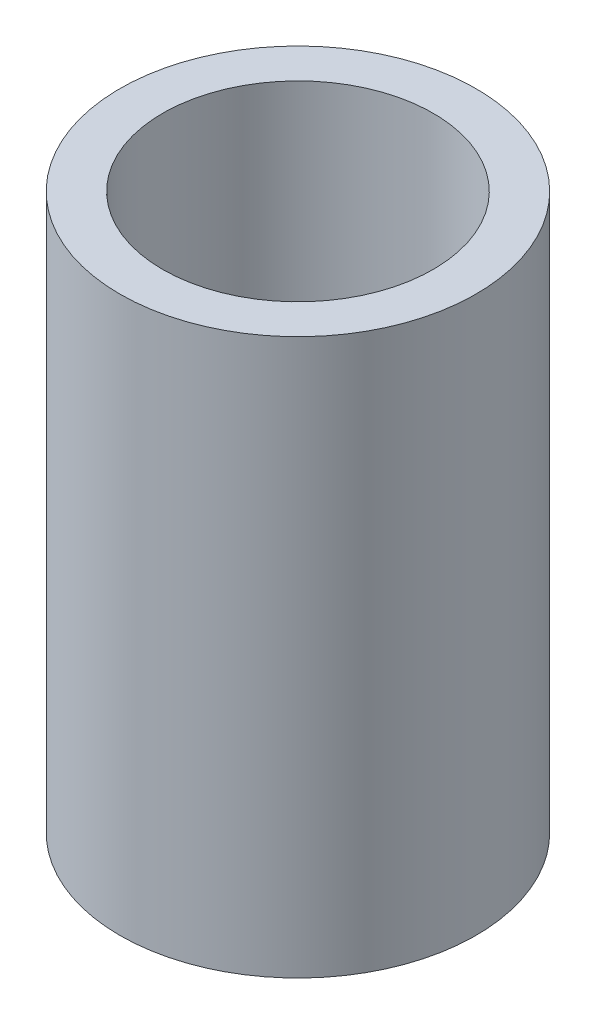
ISO-10303-21;
HEADER;
FILE_DESCRIPTION(('STEP AP214'),'2;1');
FILE_NAME('part.step','',(''),(''),'','','');
FILE_SCHEMA(('AUTOMOTIVE_DESIGN { 1 0 10303 214 1 1 1 1 }'));
ENDSEC;
DATA;
#1=APPLICATION_CONTEXT('core data for automotive mechanical design processes');
#2=APPLICATION_PROTOCOL_DEFINITION('international standard','automotive_design',2000,#1);
#3=PRODUCT_CONTEXT('',#1,'mechanical');
#4=PRODUCT('Part','Part','',(#3));
#5=PRODUCT_RELATED_PRODUCT_CATEGORY('part','',(#4));
#6=PRODUCT_DEFINITION_FORMATION('','',#4);
#7=PRODUCT_DEFINITION_CONTEXT('part definition',#1,'design');
#8=PRODUCT_DEFINITION('design','',#6,#7);
#9=PRODUCT_DEFINITION_SHAPE('','',#8);
#10=(LENGTH_UNIT() NAMED_UNIT(*) SI_UNIT(.MILLI.,.METRE.));
#11=(NAMED_UNIT(*) PLANE_ANGLE_UNIT() SI_UNIT($,.RADIAN.));
#12=(NAMED_UNIT(*) SI_UNIT($,.STERADIAN.) SOLID_ANGLE_UNIT());
#13=UNCERTAINTY_MEASURE_WITH_UNIT(LENGTH_MEASURE(1.E-05),#10,'distance_accuracy_value','');
#14=(GEOMETRIC_REPRESENTATION_CONTEXT(3) GLOBAL_UNCERTAINTY_ASSIGNED_CONTEXT((#13)) GLOBAL_UNIT_ASSIGNED_CONTEXT((#10,
#11,#12)) REPRESENTATION_CONTEXT('',''));
#15=CARTESIAN_POINT('',(0.,0.,0.));
#16=DIRECTION('',(0.,0.,1.));
#17=DIRECTION('',(1.,0.,0.));
#18=AXIS2_PLACEMENT_3D('',#15,#16,#17);
#19=CARTESIAN_POINT('',(0.,39.,0.));
#20=DIRECTION('',(0.,1.,0.));
#21=DIRECTION('',(0.,0.,1.));
#22=AXIS2_PLACEMENT_3D('',#19,#20,#21);
#23=PLANE('',#22);
#24=CARTESIAN_POINT('',(0.,39.,0.));
#25=DIRECTION('',(0.,1.,0.));
#26=DIRECTION('',(0.,0.,1.));
#27=AXIS2_PLACEMENT_3D('',#24,#25,#26);
#28=CIRCLE('',#27,12.5);
#29=CARTESIAN_POINT('',(0.,39.,12.5));
#30=VERTEX_POINT('',#29);
#31=EDGE_CURVE('E10',#30,#30,#28,.T.);
#32=ORIENTED_EDGE('',*,*,#31,.T.);
#33=EDGE_LOOP('',(#32));
#34=FACE_BOUND('',#33,.T.);
#35=CARTESIAN_POINT('',(0.,39.,0.));
#36=DIRECTION('',(0.,1.,0.));
#37=DIRECTION('',(0.,0.,1.));
#38=AXIS2_PLACEMENT_3D('',#35,#36,#37);
#39=CIRCLE('',#38,9.5);
#40=CARTESIAN_POINT('',(0.,39.,9.5));
#41=VERTEX_POINT('',#40);
#42=EDGE_CURVE('E42',#41,#41,#39,.T.);
#43=ORIENTED_EDGE('',*,*,#42,.F.);
#44=EDGE_LOOP('',(#43));
#45=FACE_BOUND('',#44,.T.);
#46=ADVANCED_FACE('F31',(#34,#45),#23,.T.);
#47=CARTESIAN_POINT('',(0.,0.,0.));
#48=DIRECTION('',(0.,1.,0.));
#49=DIRECTION('',(0.,0.,1.));
#50=AXIS2_PLACEMENT_3D('',#47,#48,#49);
#51=PLANE('',#50);
#52=CARTESIAN_POINT('',(0.,0.,0.));
#53=DIRECTION('',(0.,1.,0.));
#54=DIRECTION('',(0.,0.,1.));
#55=AXIS2_PLACEMENT_3D('',#52,#53,#54);
#56=CIRCLE('',#55,12.5);
#57=CARTESIAN_POINT('',(0.,0.,12.5));
#58=VERTEX_POINT('',#57);
#59=EDGE_CURVE('E35',#58,#58,#56,.T.);
#60=ORIENTED_EDGE('',*,*,#59,.F.);
#61=EDGE_LOOP('',(#60));
#62=FACE_BOUND('',#61,.T.);
#63=CARTESIAN_POINT('',(0.,0.,0.));
#64=DIRECTION('',(0.,1.,0.));
#65=DIRECTION('',(0.,0.,1.));
#66=AXIS2_PLACEMENT_3D('',#63,#64,#65);
#67=CIRCLE('',#66,9.5);
#68=CARTESIAN_POINT('',(0.,0.,9.5));
#69=VERTEX_POINT('',#68);
#70=EDGE_CURVE('E44',#69,#69,#67,.T.);
#71=ORIENTED_EDGE('',*,*,#70,.T.);
#72=EDGE_LOOP('',(#71));
#73=FACE_BOUND('',#72,.T.);
#74=ADVANCED_FACE('F54',(#62,#73),#51,.F.);
#75=CARTESIAN_POINT('',(0.,39.,0.));
#76=DIRECTION('',(0.,-1.,0.));
#77=DIRECTION('',(0.,0.,-1.));
#78=AXIS2_PLACEMENT_3D('',#75,#76,#77);
#79=CYLINDRICAL_SURFACE('',#78,12.5);
#80=ORIENTED_EDGE('',*,*,#31,.F.);
#81=EDGE_LOOP('',(#80));
#82=FACE_BOUND('',#81,.T.);
#83=ORIENTED_EDGE('',*,*,#59,.T.);
#84=EDGE_LOOP('',(#83));
#85=FACE_BOUND('',#84,.T.);
#86=ADVANCED_FACE('F33',(#82,#85),#79,.T.);
#87=CARTESIAN_POINT('',(0.,39.,0.));
#88=DIRECTION('',(0.,-1.,0.));
#89=DIRECTION('',(0.,0.,-1.));
#90=AXIS2_PLACEMENT_3D('',#87,#88,#89);
#91=CYLINDRICAL_SURFACE('',#90,9.5);
#92=ORIENTED_EDGE('',*,*,#42,.T.);
#93=EDGE_LOOP('',(#92));
#94=FACE_BOUND('',#93,.T.);
#95=ORIENTED_EDGE('',*,*,#70,.F.);
#96=EDGE_LOOP('',(#95));
#97=FACE_BOUND('',#96,.T.);
#98=ADVANCED_FACE('F50',(#94,#97),#91,.F.);
#99=CLOSED_SHELL('',(#46,#74,#86,#98));
#100=MANIFOLD_SOLID_BREP('B2',#99);
#101=ADVANCED_BREP_SHAPE_REPRESENTATION('',(#18,#100),#14);
#102=SHAPE_DEFINITION_REPRESENTATION(#9,#101);
ENDSEC;
END-ISO-10303-21;
